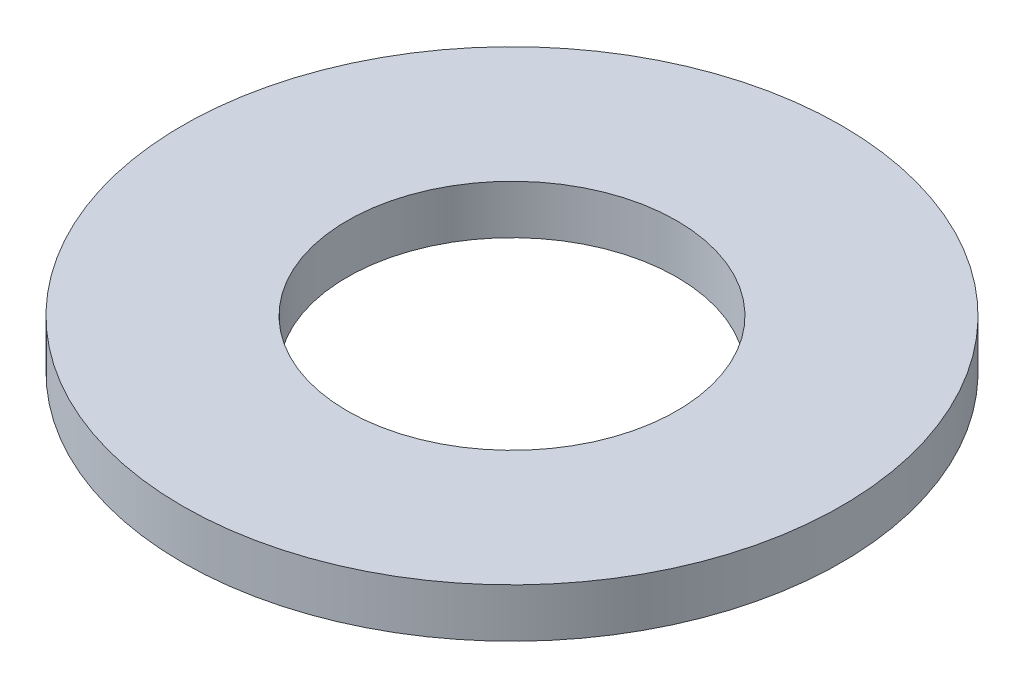
ISO-10303-21;
HEADER;
FILE_DESCRIPTION(('STEP AP214'),'2;1');
FILE_NAME('part.step','',(''),(''),'','','');
FILE_SCHEMA(('AUTOMOTIVE_DESIGN { 1 0 10303 214 1 1 1 1 }'));
ENDSEC;
DATA;
#1=APPLICATION_CONTEXT('core data for automotive mechanical design processes');
#2=APPLICATION_PROTOCOL_DEFINITION('international standard','automotive_design',2000,#1);
#3=PRODUCT_CONTEXT('',#1,'mechanical');
#4=PRODUCT('Part','Part','',(#3));
#5=PRODUCT_RELATED_PRODUCT_CATEGORY('part','',(#4));
#6=PRODUCT_DEFINITION_FORMATION('','',#4);
#7=PRODUCT_DEFINITION_CONTEXT('part definition',#1,'design');
#8=PRODUCT_DEFINITION('design','',#6,#7);
#9=PRODUCT_DEFINITION_SHAPE('','',#8);
#10=(LENGTH_UNIT() NAMED_UNIT(*) SI_UNIT(.MILLI.,.METRE.));
#11=(NAMED_UNIT(*) PLANE_ANGLE_UNIT() SI_UNIT($,.RADIAN.));
#12=(NAMED_UNIT(*) SI_UNIT($,.STERADIAN.) SOLID_ANGLE_UNIT());
#13=UNCERTAINTY_MEASURE_WITH_UNIT(LENGTH_MEASURE(1.E-05),#10,'distance_accuracy_value','');
#14=(GEOMETRIC_REPRESENTATION_CONTEXT(3) GLOBAL_UNCERTAINTY_ASSIGNED_CONTEXT((#13)) GLOBAL_UNIT_ASSIGNED_CONTEXT((#10,
#11,#12)) REPRESENTATION_CONTEXT('',''));
#15=CARTESIAN_POINT('',(0.,0.,0.));
#16=DIRECTION('',(0.,0.,1.));
#17=DIRECTION('',(1.,0.,0.));
#18=AXIS2_PLACEMENT_3D('',#15,#16,#17);
#19=CARTESIAN_POINT('',(0.,0.647699999999996,0.));
#20=DIRECTION('',(0.,1.,0.));
#21=DIRECTION('',(0.,0.,1.));
#22=AXIS2_PLACEMENT_3D('',#19,#20,#21);
#23=PLANE('',#22);
#24=CARTESIAN_POINT('',(0.,0.647699999999996,0.));
#25=DIRECTION('',(0.,1.,0.));
#26=DIRECTION('',(0.,0.,1.));
#27=AXIS2_PLACEMENT_3D('',#24,#25,#26);
#28=CIRCLE('',#27,8.7376);
#29=CARTESIAN_POINT('',(0.,0.647699999999996,8.7376));
#30=VERTEX_POINT('',#29);
#31=EDGE_CURVE('E10',#30,#30,#28,.T.);
#32=ORIENTED_EDGE('',*,*,#31,.T.);
#33=EDGE_LOOP('',(#32));
#34=FACE_BOUND('',#33,.T.);
#35=CARTESIAN_POINT('',(0.,0.647699999999996,0.));
#36=DIRECTION('',(0.,1.,0.));
#37=DIRECTION('',(0.,0.,1.));
#38=AXIS2_PLACEMENT_3D('',#35,#36,#37);
#39=CIRCLE('',#38,4.3688);
#40=CARTESIAN_POINT('',(0.,0.647699999999996,4.3688));
#41=VERTEX_POINT('',#40);
#42=EDGE_CURVE('E49',#41,#41,#39,.T.);
#43=ORIENTED_EDGE('',*,*,#42,.F.);
#44=EDGE_LOOP('',(#43));
#45=FACE_BOUND('',#44,.T.);
#46=ADVANCED_FACE('F41',(#34,#45),#23,.T.);
#47=CARTESIAN_POINT('',(0.,0.647699999999996,0.));
#48=DIRECTION('',(0.,-1.,0.));
#49=DIRECTION('',(0.,0.,-1.));
#50=AXIS2_PLACEMENT_3D('',#47,#48,#49);
#51=CYLINDRICAL_SURFACE('',#50,8.7376);
#52=ORIENTED_EDGE('',*,*,#31,.F.);
#53=EDGE_LOOP('',(#52));
#54=FACE_BOUND('',#53,.T.);
#55=CARTESIAN_POINT('',(0.,-0.647700000000004,0.));
#56=DIRECTION('',(0.,1.,0.));
#57=DIRECTION('',(0.,0.,1.));
#58=AXIS2_PLACEMENT_3D('',#55,#56,#57);
#59=CIRCLE('',#58,8.7376);
#60=CARTESIAN_POINT('',(0.,-0.647700000000004,8.7376));
#61=VERTEX_POINT('',#60);
#62=EDGE_CURVE('E54',#61,#61,#59,.T.);
#63=ORIENTED_EDGE('',*,*,#62,.T.);
#64=EDGE_LOOP('',(#63));
#65=FACE_BOUND('',#64,.T.);
#66=ADVANCED_FACE('F43',(#54,#65),#51,.T.);
#67=CARTESIAN_POINT('',(0.,0.647699999999996,0.));
#68=DIRECTION('',(0.,-1.,0.));
#69=DIRECTION('',(0.,0.,-1.));
#70=AXIS2_PLACEMENT_3D('',#67,#68,#69);
#71=CYLINDRICAL_SURFACE('',#70,4.3688);
#72=ORIENTED_EDGE('',*,*,#42,.T.);
#73=EDGE_LOOP('',(#72));
#74=FACE_BOUND('',#73,.T.);
#75=CARTESIAN_POINT('',(0.,-0.647700000000004,0.));
#76=DIRECTION('',(0.,1.,0.));
#77=DIRECTION('',(0.,0.,1.));
#78=AXIS2_PLACEMENT_3D('',#75,#76,#77);
#79=CIRCLE('',#78,4.3688);
#80=CARTESIAN_POINT('',(0.,-0.647700000000004,4.3688));
#81=VERTEX_POINT('',#80);
#82=EDGE_CURVE('E59',#81,#81,#79,.T.);
#83=ORIENTED_EDGE('',*,*,#82,.F.);
#84=EDGE_LOOP('',(#83));
#85=FACE_BOUND('',#84,.T.);
#86=ADVANCED_FACE('F69',(#74,#85),#71,.F.);
#87=CARTESIAN_POINT('',(0.,-0.647700000000004,0.));
#88=DIRECTION('',(0.,1.,0.));
#89=DIRECTION('',(0.,0.,1.));
#90=AXIS2_PLACEMENT_3D('',#87,#88,#89);
#91=PLANE('',#90);
#92=ORIENTED_EDGE('',*,*,#82,.T.);
#93=EDGE_LOOP('',(#92));
#94=FACE_BOUND('',#93,.T.);
#95=ORIENTED_EDGE('',*,*,#62,.F.);
#96=EDGE_LOOP('',(#95));
#97=FACE_BOUND('',#96,.T.);
#98=ADVANCED_FACE('F66',(#94,#97),#91,.F.);
#99=CLOSED_SHELL('',(#46,#66,#86,#98));
#100=MANIFOLD_SOLID_BREP('B2',#99);
#101=ADVANCED_BREP_SHAPE_REPRESENTATION('',(#18,#100),#14);
#102=SHAPE_DEFINITION_REPRESENTATION(#9,#101);
ENDSEC;
END-ISO-10303-21;
